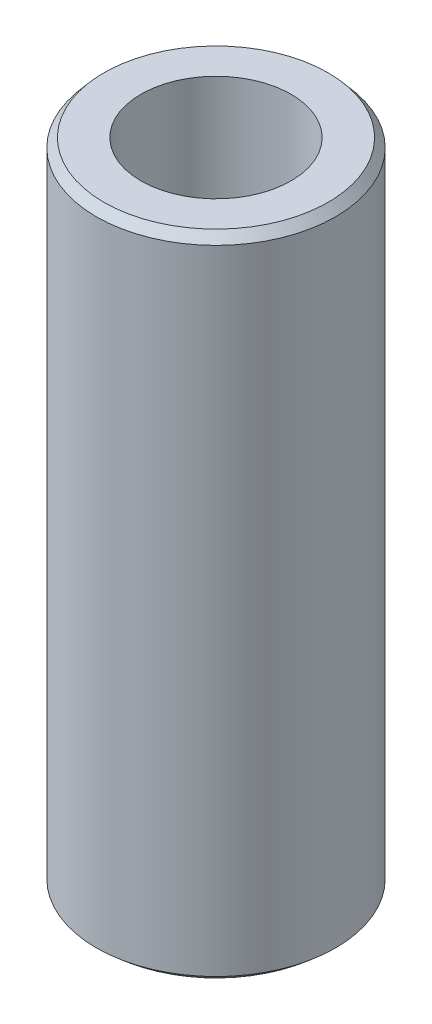
ISO-10303-21;
HEADER;
FILE_DESCRIPTION(('STEP AP214'),'2;1');
FILE_NAME('part.step','',(''),(''),'','','');
FILE_SCHEMA(('AUTOMOTIVE_DESIGN { 1 0 10303 214 1 1 1 1 }'));
ENDSEC;
DATA;
#1=APPLICATION_CONTEXT('core data for automotive mechanical design processes');
#2=APPLICATION_PROTOCOL_DEFINITION('international standard','automotive_design',2000,#1);
#3=PRODUCT_CONTEXT('',#1,'mechanical');
#4=PRODUCT('Part','Part','',(#3));
#5=PRODUCT_RELATED_PRODUCT_CATEGORY('part','',(#4));
#6=PRODUCT_DEFINITION_FORMATION('','',#4);
#7=PRODUCT_DEFINITION_CONTEXT('part definition',#1,'design');
#8=PRODUCT_DEFINITION('design','',#6,#7);
#9=PRODUCT_DEFINITION_SHAPE('','',#8);
#10=(LENGTH_UNIT() NAMED_UNIT(*) SI_UNIT(.MILLI.,.METRE.));
#11=(NAMED_UNIT(*) PLANE_ANGLE_UNIT() SI_UNIT($,.RADIAN.));
#12=(NAMED_UNIT(*) SI_UNIT($,.STERADIAN.) SOLID_ANGLE_UNIT());
#13=UNCERTAINTY_MEASURE_WITH_UNIT(LENGTH_MEASURE(1.E-05),#10,'distance_accuracy_value','');
#14=(GEOMETRIC_REPRESENTATION_CONTEXT(3) GLOBAL_UNCERTAINTY_ASSIGNED_CONTEXT((#13)) GLOBAL_UNIT_ASSIGNED_CONTEXT((#10,
#11,#12)) REPRESENTATION_CONTEXT('',''));
#15=CARTESIAN_POINT('',(0.,0.,0.));
#16=DIRECTION('',(0.,0.,1.));
#17=DIRECTION('',(1.,0.,0.));
#18=AXIS2_PLACEMENT_3D('',#15,#16,#17);
#19=CARTESIAN_POINT('',(0.,203.572110181759,0.));
#20=DIRECTION('',(0.,-1.,0.));
#21=DIRECTION('',(0.,0.,-1.));
#22=AXIS2_PLACEMENT_3D('',#19,#20,#21);
#23=CYLINDRICAL_SURFACE('',#22,37.5);
#24=CARTESIAN_POINT('',(0.,200.810153913016,0.));
#25=DIRECTION('',(0.,1.,0.));
#26=DIRECTION('',(0.,0.,1.));
#27=AXIS2_PLACEMENT_3D('',#24,#25,#26);
#28=CIRCLE('',#27,37.5);
#29=CARTESIAN_POINT('',(0.,200.810153913016,37.5));
#30=VERTEX_POINT('',#29);
#31=EDGE_CURVE('E50',#30,#30,#28,.F.);
#32=ORIENTED_EDGE('',*,*,#31,.T.);
#33=EDGE_LOOP('',(#32));
#34=FACE_BOUND('',#33,.T.);
#35=CARTESIAN_POINT('',(0.,2.34716313328664,0.));
#36=DIRECTION('',(0.,1.,0.));
#37=DIRECTION('',(0.,0.,1.));
#38=AXIS2_PLACEMENT_3D('',#35,#36,#37);
#39=CIRCLE('',#38,37.5);
#40=CARTESIAN_POINT('',(0.,2.34716313328664,37.5));
#41=VERTEX_POINT('',#40);
#42=EDGE_CURVE('E51',#41,#41,#39,.T.);
#43=ORIENTED_EDGE('',*,*,#42,.T.);
#44=EDGE_LOOP('',(#43));
#45=FACE_BOUND('',#44,.T.);
#46=ADVANCED_FACE('F39',(#34,#45),#23,.T.);
#47=CARTESIAN_POINT('',(0.,203.572110181759,0.));
#48=DIRECTION('',(0.,1.,0.));
#49=DIRECTION('',(0.,0.,1.));
#50=AXIS2_PLACEMENT_3D('',#47,#48,#49);
#51=PLANE('',#50);
#52=CARTESIAN_POINT('',(0.,203.572110181759,0.));
#53=DIRECTION('',(0.,1.,0.));
#54=DIRECTION('',(0.,0.,1.));
#55=AXIS2_PLACEMENT_3D('',#52,#53,#54);
#56=CIRCLE('',#55,35.1528368667133);
#57=CARTESIAN_POINT('',(0.,203.572110181759,35.1528368667133));
#58=VERTEX_POINT('',#57);
#59=EDGE_CURVE('E54',#58,#58,#56,.T.);
#60=ORIENTED_EDGE('',*,*,#59,.T.);
#61=EDGE_LOOP('',(#60));
#62=FACE_BOUND('',#61,.T.);
#63=CARTESIAN_POINT('',(0.,203.572110181759,0.));
#64=DIRECTION('',(0.,1.,0.));
#65=DIRECTION('',(0.,0.,1.));
#66=AXIS2_PLACEMENT_3D('',#63,#64,#65);
#67=CIRCLE('',#66,23.5360555212968);
#68=CARTESIAN_POINT('',(0.,203.572110181759,23.5360555212968));
#69=VERTEX_POINT('',#68);
#70=EDGE_CURVE('E58',#69,#69,#67,.T.);
#71=ORIENTED_EDGE('',*,*,#70,.F.);
#72=EDGE_LOOP('',(#71));
#73=FACE_BOUND('',#72,.T.);
#74=ADVANCED_FACE('F69',(#62,#73),#51,.T.);
#75=CARTESIAN_POINT('',(0.,0.,0.));
#76=DIRECTION('',(0.,1.,0.));
#77=DIRECTION('',(0.,0.,1.));
#78=AXIS2_PLACEMENT_3D('',#75,#76,#77);
#79=PLANE('',#78);
#80=CARTESIAN_POINT('',(0.,0.,0.));
#81=DIRECTION('',(0.,1.,0.));
#82=DIRECTION('',(0.,0.,1.));
#83=AXIS2_PLACEMENT_3D('',#80,#81,#82);
#84=CIRCLE('',#83,34.7380437312568);
#85=CARTESIAN_POINT('',(0.,0.,34.7380437312568));
#86=VERTEX_POINT('',#85);
#87=EDGE_CURVE('E10',#86,#86,#84,.F.);
#88=ORIENTED_EDGE('',*,*,#87,.T.);
#89=EDGE_LOOP('',(#88));
#90=FACE_BOUND('',#89,.T.);
#91=CARTESIAN_POINT('',(0.,0.,0.));
#92=DIRECTION('',(0.,1.,0.));
#93=DIRECTION('',(0.,0.,1.));
#94=AXIS2_PLACEMENT_3D('',#91,#92,#93);
#95=CIRCLE('',#94,23.5360555212968);
#96=CARTESIAN_POINT('',(0.,0.,23.5360555212968));
#97=VERTEX_POINT('',#96);
#98=EDGE_CURVE('E63',#97,#97,#95,.T.);
#99=ORIENTED_EDGE('',*,*,#98,.T.);
#100=EDGE_LOOP('',(#99));
#101=FACE_BOUND('',#100,.T.);
#102=ADVANCED_FACE('F75',(#90,#101),#79,.F.);
#103=CARTESIAN_POINT('',(0.,203.572110181759,0.));
#104=DIRECTION('',(0.,-1.,0.));
#105=DIRECTION('',(0.,0.,-1.));
#106=AXIS2_PLACEMENT_3D('',#103,#104,#105);
#107=CYLINDRICAL_SURFACE('',#106,23.5360555212968);
#108=ORIENTED_EDGE('',*,*,#70,.T.);
#109=EDGE_LOOP('',(#108));
#110=FACE_BOUND('',#109,.T.);
#111=ORIENTED_EDGE('',*,*,#98,.F.);
#112=EDGE_LOOP('',(#111));
#113=FACE_BOUND('',#112,.T.);
#114=ADVANCED_FACE('F70',(#110,#113),#107,.F.);
#115=CARTESIAN_POINT('',(0.,203.572110181759,0.));
#116=DIRECTION('',(0.,-1.,0.));
#117=DIRECTION('',(0.,0.,-1.));
#118=AXIS2_PLACEMENT_3D('',#115,#116,#117);
#119=CONICAL_SURFACE('',#118,35.1528368667133,0.704389021058828);
#120=ORIENTED_EDGE('',*,*,#31,.F.);
#121=EDGE_LOOP('',(#120));
#122=FACE_BOUND('',#121,.T.);
#123=ORIENTED_EDGE('',*,*,#59,.F.);
#124=EDGE_LOOP('',(#123));
#125=FACE_BOUND('',#124,.T.);
#126=ADVANCED_FACE('F81',(#122,#125),#119,.T.);
#127=CARTESIAN_POINT('',(0.,2.34716313328664,0.));
#128=DIRECTION('',(0.,1.,0.));
#129=DIRECTION('',(0.,0.,1.));
#130=AXIS2_PLACEMENT_3D('',#127,#128,#129);
#131=CONICAL_SURFACE('',#130,37.5,0.866407305736074);
#132=ORIENTED_EDGE('',*,*,#87,.F.);
#133=EDGE_LOOP('',(#132));
#134=FACE_BOUND('',#133,.T.);
#135=ORIENTED_EDGE('',*,*,#42,.F.);
#136=EDGE_LOOP('',(#135));
#137=FACE_BOUND('',#136,.T.);
#138=ADVANCED_FACE('F45',(#134,#137),#131,.T.);
#139=CLOSED_SHELL('',(#46,#74,#102,#114,#126,#138));
#140=MANIFOLD_SOLID_BREP('B2',#139);
#141=ADVANCED_BREP_SHAPE_REPRESENTATION('',(#18,#140),#14);
#142=SHAPE_DEFINITION_REPRESENTATION(#9,#141);
ENDSEC;
END-ISO-10303-21;
